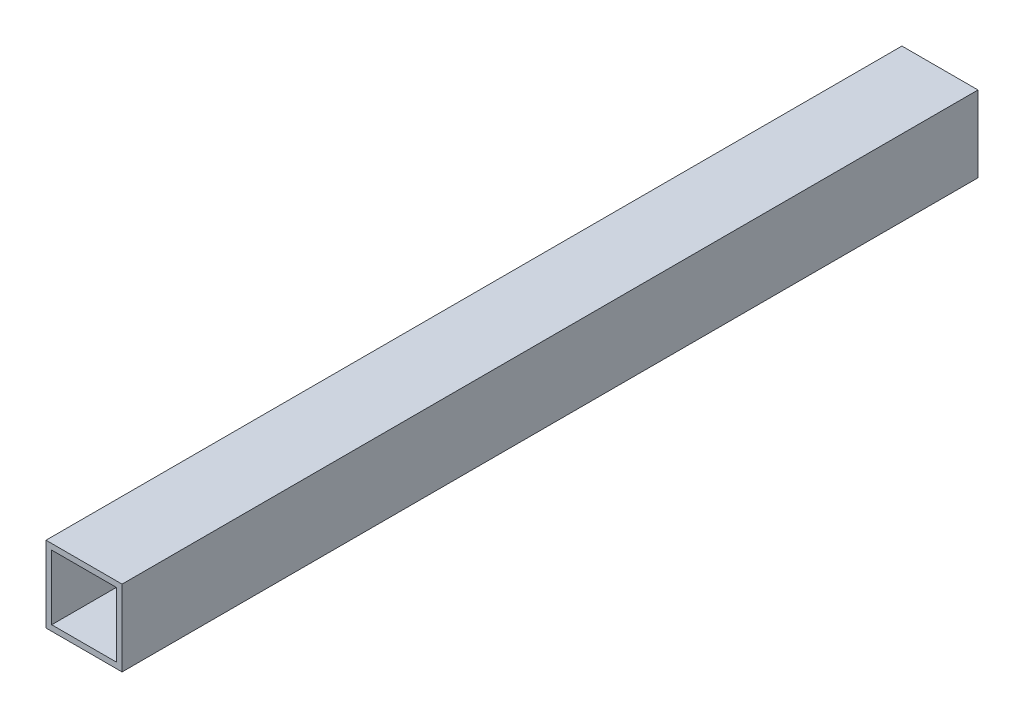
ISO-10303-21;
HEADER;
FILE_DESCRIPTION(('STEP AP214'),'2;1');
FILE_NAME('part.step','',(''),(''),'','','');
FILE_SCHEMA(('AUTOMOTIVE_DESIGN { 1 0 10303 214 1 1 1 1 }'));
ENDSEC;
DATA;
#1=APPLICATION_CONTEXT('core data for automotive mechanical design processes');
#2=APPLICATION_PROTOCOL_DEFINITION('international standard','automotive_design',2000,#1);
#3=PRODUCT_CONTEXT('',#1,'mechanical');
#4=PRODUCT('Part','Part','',(#3));
#5=PRODUCT_RELATED_PRODUCT_CATEGORY('part','',(#4));
#6=PRODUCT_DEFINITION_FORMATION('','',#4);
#7=PRODUCT_DEFINITION_CONTEXT('part definition',#1,'design');
#8=PRODUCT_DEFINITION('design','',#6,#7);
#9=PRODUCT_DEFINITION_SHAPE('','',#8);
#10=(LENGTH_UNIT() NAMED_UNIT(*) SI_UNIT(.MILLI.,.METRE.));
#11=(NAMED_UNIT(*) PLANE_ANGLE_UNIT() SI_UNIT($,.RADIAN.));
#12=(NAMED_UNIT(*) SI_UNIT($,.STERADIAN.) SOLID_ANGLE_UNIT());
#13=UNCERTAINTY_MEASURE_WITH_UNIT(LENGTH_MEASURE(1.E-05),#10,'distance_accuracy_value','');
#14=(GEOMETRIC_REPRESENTATION_CONTEXT(3) GLOBAL_UNCERTAINTY_ASSIGNED_CONTEXT((#13)) GLOBAL_UNIT_ASSIGNED_CONTEXT((#10,
#11,#12)) REPRESENTATION_CONTEXT('',''));
#15=CARTESIAN_POINT('',(0.,0.,0.));
#16=DIRECTION('',(0.,0.,1.));
#17=DIRECTION('',(1.,0.,0.));
#18=AXIS2_PLACEMENT_3D('',#15,#16,#17);
#19=CARTESIAN_POINT('',(0.,0.,450.));
#20=DIRECTION('',(0.,0.,1.));
#21=DIRECTION('',(1.,0.,0.));
#22=AXIS2_PLACEMENT_3D('',#19,#20,#21);
#23=PLANE('',#22);
#24=DIRECTION('',(0.,1.,0.));
#25=VECTOR('',#24,1.);
#26=CARTESIAN_POINT('',(20.,20.,450.));
#27=LINE('',#26,#25);
#28=CARTESIAN_POINT('',(20.,-20.,450.));
#29=VERTEX_POINT('',#28);
#30=CARTESIAN_POINT('',(20.,20.,450.));
#31=VERTEX_POINT('',#30);
#32=EDGE_CURVE('E146',#29,#31,#27,.T.);
#33=ORIENTED_EDGE('',*,*,#32,.T.);
#34=DIRECTION('',(-1.,0.,0.));
#35=VECTOR('',#34,1.);
#36=CARTESIAN_POINT('',(-20.,20.,450.));
#37=LINE('',#36,#35);
#38=CARTESIAN_POINT('',(-20.,20.,450.));
#39=VERTEX_POINT('',#38);
#40=EDGE_CURVE('E149',#31,#39,#37,.T.);
#41=ORIENTED_EDGE('',*,*,#40,.T.);
#42=DIRECTION('',(0.,-1.,0.));
#43=VECTOR('',#42,1.);
#44=CARTESIAN_POINT('',(-20.,20.,450.));
#45=LINE('',#44,#43);
#46=CARTESIAN_POINT('',(-20.,-20.,450.));
#47=VERTEX_POINT('',#46);
#48=EDGE_CURVE('E152',#39,#47,#45,.T.);
#49=ORIENTED_EDGE('',*,*,#48,.T.);
#50=DIRECTION('',(1.,0.,0.));
#51=VECTOR('',#50,1.);
#52=CARTESIAN_POINT('',(-20.,-20.,450.));
#53=LINE('',#52,#51);
#54=EDGE_CURVE('E154',#47,#29,#53,.T.);
#55=ORIENTED_EDGE('',*,*,#54,.T.);
#56=EDGE_LOOP('',(#33,#41,#49,#55));
#57=FACE_BOUND('',#56,.T.);
#58=DIRECTION('',(1.,0.,0.));
#59=VECTOR('',#58,1.);
#60=CARTESIAN_POINT('',(-17.,-17.,450.));
#61=LINE('',#60,#59);
#62=CARTESIAN_POINT('',(-17.,-17.,450.));
#63=VERTEX_POINT('',#62);
#64=CARTESIAN_POINT('',(17.,-17.,450.));
#65=VERTEX_POINT('',#64);
#66=EDGE_CURVE('E118',#63,#65,#61,.T.);
#67=ORIENTED_EDGE('',*,*,#66,.F.);
#68=DIRECTION('',(0.,-1.,0.));
#69=VECTOR('',#68,1.);
#70=CARTESIAN_POINT('',(-17.,17.,450.));
#71=LINE('',#70,#69);
#72=CARTESIAN_POINT('',(-17.,17.,450.));
#73=VERTEX_POINT('',#72);
#74=EDGE_CURVE('E110',#73,#63,#71,.T.);
#75=ORIENTED_EDGE('',*,*,#74,.F.);
#76=DIRECTION('',(-1.,0.,0.));
#77=VECTOR('',#76,1.);
#78=CARTESIAN_POINT('',(-17.,17.,450.));
#79=LINE('',#78,#77);
#80=CARTESIAN_POINT('',(17.,17.,450.));
#81=VERTEX_POINT('',#80);
#82=EDGE_CURVE('E132',#81,#73,#79,.T.);
#83=ORIENTED_EDGE('',*,*,#82,.F.);
#84=DIRECTION('',(0.,1.,0.));
#85=VECTOR('',#84,1.);
#86=CARTESIAN_POINT('',(17.,17.,450.));
#87=LINE('',#86,#85);
#88=EDGE_CURVE('E130',#65,#81,#87,.T.);
#89=ORIENTED_EDGE('',*,*,#88,.F.);
#90=EDGE_LOOP('',(#67,#75,#83,#89));
#91=FACE_BOUND('',#90,.T.);
#92=ADVANCED_FACE('F45',(#57,#91),#23,.T.);
#93=CARTESIAN_POINT('',(0.,0.,0.));
#94=DIRECTION('',(0.,0.,1.));
#95=DIRECTION('',(1.,0.,0.));
#96=AXIS2_PLACEMENT_3D('',#93,#94,#95);
#97=PLANE('',#96);
#98=DIRECTION('',(0.,1.,0.));
#99=VECTOR('',#98,1.);
#100=CARTESIAN_POINT('',(20.,20.,0.));
#101=LINE('',#100,#99);
#102=CARTESIAN_POINT('',(20.,-20.,0.));
#103=VERTEX_POINT('',#102);
#104=CARTESIAN_POINT('',(20.,20.,0.));
#105=VERTEX_POINT('',#104);
#106=EDGE_CURVE('E126',#103,#105,#101,.T.);
#107=ORIENTED_EDGE('',*,*,#106,.F.);
#108=DIRECTION('',(1.,0.,0.));
#109=VECTOR('',#108,1.);
#110=CARTESIAN_POINT('',(-20.,-20.,0.));
#111=LINE('',#110,#109);
#112=CARTESIAN_POINT('',(-20.,-20.,0.));
#113=VERTEX_POINT('',#112);
#114=EDGE_CURVE('E150',#113,#103,#111,.T.);
#115=ORIENTED_EDGE('',*,*,#114,.F.);
#116=DIRECTION('',(0.,-1.,0.));
#117=VECTOR('',#116,1.);
#118=CARTESIAN_POINT('',(-20.,20.,0.));
#119=LINE('',#118,#117);
#120=CARTESIAN_POINT('',(-20.,20.,0.));
#121=VERTEX_POINT('',#120);
#122=EDGE_CURVE('E161',#121,#113,#119,.T.);
#123=ORIENTED_EDGE('',*,*,#122,.F.);
#124=DIRECTION('',(-1.,0.,0.));
#125=VECTOR('',#124,1.);
#126=CARTESIAN_POINT('',(-20.,20.,0.));
#127=LINE('',#126,#125);
#128=EDGE_CURVE('E159',#105,#121,#127,.T.);
#129=ORIENTED_EDGE('',*,*,#128,.F.);
#130=EDGE_LOOP('',(#107,#115,#123,#129));
#131=FACE_BOUND('',#130,.T.);
#132=DIRECTION('',(0.,-1.,0.));
#133=VECTOR('',#132,1.);
#134=CARTESIAN_POINT('',(-17.,17.,0.));
#135=LINE('',#134,#133);
#136=CARTESIAN_POINT('',(-17.,17.,0.));
#137=VERTEX_POINT('',#136);
#138=CARTESIAN_POINT('',(-17.,-17.,0.));
#139=VERTEX_POINT('',#138);
#140=EDGE_CURVE('E68',#137,#139,#135,.T.);
#141=ORIENTED_EDGE('',*,*,#140,.T.);
#142=DIRECTION('',(1.,0.,0.));
#143=VECTOR('',#142,1.);
#144=CARTESIAN_POINT('',(-17.,-17.,0.));
#145=LINE('',#144,#143);
#146=CARTESIAN_POINT('',(17.,-17.,0.));
#147=VERTEX_POINT('',#146);
#148=EDGE_CURVE('E125',#139,#147,#145,.T.);
#149=ORIENTED_EDGE('',*,*,#148,.T.);
#150=DIRECTION('',(0.,1.,0.));
#151=VECTOR('',#150,1.);
#152=CARTESIAN_POINT('',(17.,17.,0.));
#153=LINE('',#152,#151);
#154=CARTESIAN_POINT('',(17.,17.,0.));
#155=VERTEX_POINT('',#154);
#156=EDGE_CURVE('E138',#147,#155,#153,.T.);
#157=ORIENTED_EDGE('',*,*,#156,.T.);
#158=DIRECTION('',(-1.,0.,0.));
#159=VECTOR('',#158,1.);
#160=CARTESIAN_POINT('',(-17.,17.,0.));
#161=LINE('',#160,#159);
#162=EDGE_CURVE('E119',#155,#137,#161,.T.);
#163=ORIENTED_EDGE('',*,*,#162,.T.);
#164=EDGE_LOOP('',(#141,#149,#157,#163));
#165=FACE_BOUND('',#164,.T.);
#166=ADVANCED_FACE('F179',(#131,#165),#97,.F.);
#167=CARTESIAN_POINT('',(20.,20.,450.));
#168=DIRECTION('',(-1.,0.,0.));
#169=DIRECTION('',(0.,-1.,0.));
#170=AXIS2_PLACEMENT_3D('',#167,#168,#169);
#171=PLANE('',#170);
#172=ORIENTED_EDGE('',*,*,#106,.T.);
#173=DIRECTION('',(0.,0.,-1.));
#174=VECTOR('',#173,1.);
#175=CARTESIAN_POINT('',(20.,20.,450.));
#176=LINE('',#175,#174);
#177=EDGE_CURVE('E11',#31,#105,#176,.T.);
#178=ORIENTED_EDGE('',*,*,#177,.F.);
#179=ORIENTED_EDGE('',*,*,#32,.F.);
#180=DIRECTION('',(0.,0.,-1.));
#181=VECTOR('',#180,1.);
#182=CARTESIAN_POINT('',(20.,-20.,450.));
#183=LINE('',#182,#181);
#184=EDGE_CURVE('E156',#29,#103,#183,.T.);
#185=ORIENTED_EDGE('',*,*,#184,.T.);
#186=EDGE_LOOP('',(#172,#178,#179,#185));
#187=FACE_BOUND('',#186,.T.);
#188=ADVANCED_FACE('F47',(#187),#171,.F.);
#189=CARTESIAN_POINT('',(-20.,20.,450.));
#190=DIRECTION('',(0.,-1.,0.));
#191=DIRECTION('',(0.,0.,-1.));
#192=AXIS2_PLACEMENT_3D('',#189,#190,#191);
#193=PLANE('',#192);
#194=ORIENTED_EDGE('',*,*,#128,.T.);
#195=DIRECTION('',(0.,0.,-1.));
#196=VECTOR('',#195,1.);
#197=CARTESIAN_POINT('',(-20.,20.,450.));
#198=LINE('',#197,#196);
#199=EDGE_CURVE('E53',#39,#121,#198,.T.);
#200=ORIENTED_EDGE('',*,*,#199,.F.);
#201=ORIENTED_EDGE('',*,*,#40,.F.);
#202=ORIENTED_EDGE('',*,*,#177,.T.);
#203=EDGE_LOOP('',(#194,#200,#201,#202));
#204=FACE_BOUND('',#203,.T.);
#205=ADVANCED_FACE('F189',(#204),#193,.F.);
#206=CARTESIAN_POINT('',(-20.,20.,450.));
#207=DIRECTION('',(1.,0.,0.));
#208=DIRECTION('',(0.,1.,0.));
#209=AXIS2_PLACEMENT_3D('',#206,#207,#208);
#210=PLANE('',#209);
#211=ORIENTED_EDGE('',*,*,#122,.T.);
#212=DIRECTION('',(0.,0.,-1.));
#213=VECTOR('',#212,1.);
#214=CARTESIAN_POINT('',(-20.,-20.,450.));
#215=LINE('',#214,#213);
#216=EDGE_CURVE('E166',#47,#113,#215,.T.);
#217=ORIENTED_EDGE('',*,*,#216,.F.);
#218=ORIENTED_EDGE('',*,*,#48,.F.);
#219=ORIENTED_EDGE('',*,*,#199,.T.);
#220=EDGE_LOOP('',(#211,#217,#218,#219));
#221=FACE_BOUND('',#220,.T.);
#222=ADVANCED_FACE('F173',(#221),#210,.F.);
#223=CARTESIAN_POINT('',(-20.,-20.,450.));
#224=DIRECTION('',(0.,1.,0.));
#225=DIRECTION('',(0.,0.,1.));
#226=AXIS2_PLACEMENT_3D('',#223,#224,#225);
#227=PLANE('',#226);
#228=ORIENTED_EDGE('',*,*,#114,.T.);
#229=ORIENTED_EDGE('',*,*,#184,.F.);
#230=ORIENTED_EDGE('',*,*,#54,.F.);
#231=ORIENTED_EDGE('',*,*,#216,.T.);
#232=EDGE_LOOP('',(#228,#229,#230,#231));
#233=FACE_BOUND('',#232,.T.);
#234=ADVANCED_FACE('F183',(#233),#227,.F.);
#235=CARTESIAN_POINT('',(-17.,17.,450.));
#236=DIRECTION('',(1.,0.,0.));
#237=DIRECTION('',(0.,0.,-1.));
#238=AXIS2_PLACEMENT_3D('',#235,#236,#237);
#239=PLANE('',#238);
#240=ORIENTED_EDGE('',*,*,#140,.F.);
#241=DIRECTION('',(0.,0.,-1.));
#242=VECTOR('',#241,1.);
#243=CARTESIAN_POINT('',(-17.,17.,450.));
#244=LINE('',#243,#242);
#245=EDGE_CURVE('E114',#73,#137,#244,.T.);
#246=ORIENTED_EDGE('',*,*,#245,.F.);
#247=ORIENTED_EDGE('',*,*,#74,.T.);
#248=DIRECTION('',(0.,0.,-1.));
#249=VECTOR('',#248,1.);
#250=CARTESIAN_POINT('',(-17.,-17.,450.));
#251=LINE('',#250,#249);
#252=EDGE_CURVE('E113',#63,#139,#251,.T.);
#253=ORIENTED_EDGE('',*,*,#252,.T.);
#254=EDGE_LOOP('',(#240,#246,#247,#253));
#255=FACE_BOUND('',#254,.T.);
#256=ADVANCED_FACE('F112',(#255),#239,.T.);
#257=CARTESIAN_POINT('',(-17.,-17.,450.));
#258=DIRECTION('',(0.,1.,0.));
#259=DIRECTION('',(-1.,0.,0.));
#260=AXIS2_PLACEMENT_3D('',#257,#258,#259);
#261=PLANE('',#260);
#262=ORIENTED_EDGE('',*,*,#148,.F.);
#263=ORIENTED_EDGE('',*,*,#252,.F.);
#264=ORIENTED_EDGE('',*,*,#66,.T.);
#265=DIRECTION('',(0.,0.,-1.));
#266=VECTOR('',#265,1.);
#267=CARTESIAN_POINT('',(17.,-17.,450.));
#268=LINE('',#267,#266);
#269=EDGE_CURVE('E127',#65,#147,#268,.T.);
#270=ORIENTED_EDGE('',*,*,#269,.T.);
#271=EDGE_LOOP('',(#262,#263,#264,#270));
#272=FACE_BOUND('',#271,.T.);
#273=ADVANCED_FACE('F122',(#272),#261,.T.);
#274=CARTESIAN_POINT('',(17.,17.,450.));
#275=DIRECTION('',(-1.,0.,0.));
#276=DIRECTION('',(0.,0.,1.));
#277=AXIS2_PLACEMENT_3D('',#274,#275,#276);
#278=PLANE('',#277);
#279=ORIENTED_EDGE('',*,*,#156,.F.);
#280=ORIENTED_EDGE('',*,*,#269,.F.);
#281=ORIENTED_EDGE('',*,*,#88,.T.);
#282=DIRECTION('',(0.,0.,-1.));
#283=VECTOR('',#282,1.);
#284=CARTESIAN_POINT('',(17.,17.,450.));
#285=LINE('',#284,#283);
#286=EDGE_CURVE('E60',#81,#155,#285,.T.);
#287=ORIENTED_EDGE('',*,*,#286,.T.);
#288=EDGE_LOOP('',(#279,#280,#281,#287));
#289=FACE_BOUND('',#288,.T.);
#290=ADVANCED_FACE('F212',(#289),#278,.T.);
#291=CARTESIAN_POINT('',(-17.,17.,450.));
#292=DIRECTION('',(0.,-1.,0.));
#293=DIRECTION('',(0.,0.,-1.));
#294=AXIS2_PLACEMENT_3D('',#291,#292,#293);
#295=PLANE('',#294);
#296=ORIENTED_EDGE('',*,*,#162,.F.);
#297=ORIENTED_EDGE('',*,*,#286,.F.);
#298=ORIENTED_EDGE('',*,*,#82,.T.);
#299=ORIENTED_EDGE('',*,*,#245,.T.);
#300=EDGE_LOOP('',(#296,#297,#298,#299));
#301=FACE_BOUND('',#300,.T.);
#302=ADVANCED_FACE('F216',(#301),#295,.T.);
#303=CLOSED_SHELL('',(#92,#166,#188,#205,#222,#234,#256,#273,#290,#302));
#304=MANIFOLD_SOLID_BREP('B2',#303);
#305=ADVANCED_BREP_SHAPE_REPRESENTATION('',(#18,#304),#14);
#306=SHAPE_DEFINITION_REPRESENTATION(#9,#305);
ENDSEC;
END-ISO-10303-21;
